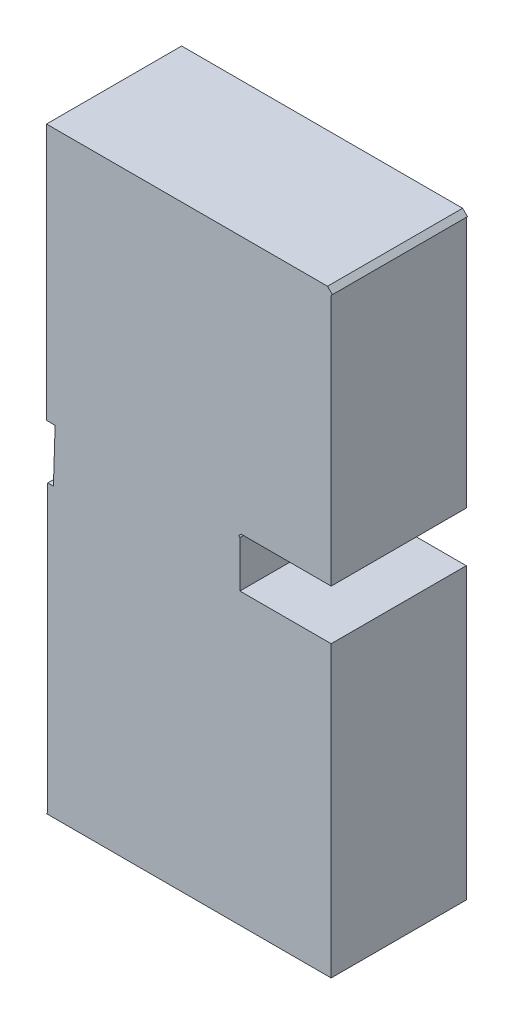
ISO-10303-21;
HEADER;
FILE_DESCRIPTION(('STEP AP214'),'2;1');
FILE_NAME('part.step','',(''),(''),'','','');
FILE_SCHEMA(('AUTOMOTIVE_DESIGN { 1 0 10303 214 1 1 1 1 }'));
ENDSEC;
DATA;
#1=APPLICATION_CONTEXT('core data for automotive mechanical design processes');
#2=APPLICATION_PROTOCOL_DEFINITION('international standard','automotive_design',2000,#1);
#3=PRODUCT_CONTEXT('',#1,'mechanical');
#4=PRODUCT('Part','Part','',(#3));
#5=PRODUCT_RELATED_PRODUCT_CATEGORY('part','',(#4));
#6=PRODUCT_DEFINITION_FORMATION('','',#4);
#7=PRODUCT_DEFINITION_CONTEXT('part definition',#1,'design');
#8=PRODUCT_DEFINITION('design','',#6,#7);
#9=PRODUCT_DEFINITION_SHAPE('','',#8);
#10=(LENGTH_UNIT() NAMED_UNIT(*) SI_UNIT(.MILLI.,.METRE.));
#11=(NAMED_UNIT(*) PLANE_ANGLE_UNIT() SI_UNIT($,.RADIAN.));
#12=(NAMED_UNIT(*) SI_UNIT($,.STERADIAN.) SOLID_ANGLE_UNIT());
#13=UNCERTAINTY_MEASURE_WITH_UNIT(LENGTH_MEASURE(1.E-05),#10,'distance_accuracy_value','');
#14=(GEOMETRIC_REPRESENTATION_CONTEXT(3) GLOBAL_UNCERTAINTY_ASSIGNED_CONTEXT((#13)) GLOBAL_UNIT_ASSIGNED_CONTEXT((#10,
#11,#12)) REPRESENTATION_CONTEXT('',''));
#15=CARTESIAN_POINT('',(0.,0.,0.));
#16=DIRECTION('',(0.,0.,1.));
#17=DIRECTION('',(1.,0.,0.));
#18=AXIS2_PLACEMENT_3D('',#15,#16,#17);
#19=CARTESIAN_POINT('',(-1.1635613,-2.4310975,1.10000034));
#20=DIRECTION('',(0.,0.,-1.));
#21=DIRECTION('',(0.,-1.,0.));
#22=AXIS2_PLACEMENT_3D('',#19,#20,#21);
#23=PLANE('',#22);
#24=DIRECTION('',(0.707106781186548,0.707106781186548,0.));
#25=VECTOR('',#24,1.);
#26=CARTESIAN_POINT('',(-1.1635613,-2.4310975,1.10000034));
#27=LINE('',#26,#25);
#28=CARTESIAN_POINT('',(-1.1635613,-2.4310975,1.10000034));
#29=VERTEX_POINT('',#28);
#30=CARTESIAN_POINT('',(-1.1536553,-2.4211915,1.10000034));
#31=VERTEX_POINT('',#30);
#32=EDGE_CURVE('E214',#29,#31,#27,.T.);
#33=ORIENTED_EDGE('',*,*,#32,.F.);
#34=DIRECTION('',(-1.,0.,0.));
#35=VECTOR('',#34,1.);
#36=CARTESIAN_POINT('',(1.1536807,-2.4310975,1.10000034));
#37=LINE('',#36,#35);
#38=CARTESIAN_POINT('',(1.1536807,-2.4310975,1.10000034));
#39=VERTEX_POINT('',#38);
#40=EDGE_CURVE('E28',#39,#29,#37,.T.);
#41=ORIENTED_EDGE('',*,*,#40,.F.);
#42=DIRECTION('',(0.,-1.,0.));
#43=VECTOR('',#42,1.);
#44=CARTESIAN_POINT('',(1.1536807,-0.0742569,1.10000034));
#45=LINE('',#44,#43);
#46=CARTESIAN_POINT('',(1.1536807,-0.0742569,1.10000034));
#47=VERTEX_POINT('',#46);
#48=EDGE_CURVE('E324',#47,#39,#45,.T.);
#49=ORIENTED_EDGE('',*,*,#48,.F.);
#50=DIRECTION('',(1.,0.,0.));
#51=VECTOR('',#50,1.);
#52=CARTESIAN_POINT('',(0.4109847,-0.0742569,1.10000034));
#53=LINE('',#52,#51);
#54=CARTESIAN_POINT('',(0.4109847,-0.0742569,1.10000034));
#55=VERTEX_POINT('',#54);
#56=EDGE_CURVE('E85',#55,#47,#53,.T.);
#57=ORIENTED_EDGE('',*,*,#56,.F.);
#58=DIRECTION('',(0.,-1.,0.));
#59=VECTOR('',#58,1.);
#60=CARTESIAN_POINT('',(0.4109847,0.3020441,1.10000034));
#61=LINE('',#60,#59);
#62=CARTESIAN_POINT('',(0.4109847,0.3020441,1.10000034));
#63=VERTEX_POINT('',#62);
#64=EDGE_CURVE('E340',#63,#55,#61,.T.);
#65=ORIENTED_EDGE('',*,*,#64,.F.);
#66=DIRECTION('',(0.707106781186548,-0.707106781186548,0.));
#67=VECTOR('',#66,1.);
#68=CARTESIAN_POINT('',(0.4010787,0.3119501,1.10000034));
#69=LINE('',#68,#67);
#70=CARTESIAN_POINT('',(0.4010787,0.3119501,1.10000034));
#71=VERTEX_POINT('',#70);
#72=EDGE_CURVE('E228',#71,#63,#69,.T.);
#73=ORIENTED_EDGE('',*,*,#72,.F.);
#74=DIRECTION('',(-0.707106781186548,-0.707106781186548,0.));
#75=VECTOR('',#74,1.);
#76=CARTESIAN_POINT('',(0.4208653,0.3317367,1.10000034));
#77=LINE('',#76,#75);
#78=CARTESIAN_POINT('',(0.4208653,0.3317367,1.10000034));
#79=VERTEX_POINT('',#78);
#80=EDGE_CURVE('E244',#79,#71,#77,.T.);
#81=ORIENTED_EDGE('',*,*,#80,.F.);
#82=DIRECTION('',(-1.,0.,0.));
#83=VECTOR('',#82,1.);
#84=CARTESIAN_POINT('',(1.1536807,0.3317367,1.10000034));
#85=LINE('',#84,#83);
#86=CARTESIAN_POINT('',(1.1536807,0.3317367,1.10000034));
#87=VERTEX_POINT('',#86);
#88=EDGE_CURVE('E238',#87,#79,#85,.T.);
#89=ORIENTED_EDGE('',*,*,#88,.F.);
#90=DIRECTION('',(0.,-1.,0.));
#91=VECTOR('',#90,1.);
#92=CARTESIAN_POINT('',(1.1536807,2.3816183,1.10000034));
#93=LINE('',#92,#91);
#94=CARTESIAN_POINT('',(1.1536807,2.3816183,1.10000034));
#95=VERTEX_POINT('',#94);
#96=EDGE_CURVE('E21',#95,#87,#93,.T.);
#97=ORIENTED_EDGE('',*,*,#96,.F.);
#98=DIRECTION('',(-0.707106781186548,-0.707106781186548,0.));
#99=VECTOR('',#98,1.);
#100=CARTESIAN_POINT('',(1.1635613,2.3914989,1.10000034));
#101=LINE('',#100,#99);
#102=CARTESIAN_POINT('',(1.1635613,2.3914989,1.10000034));
#103=VERTEX_POINT('',#102);
#104=EDGE_CURVE('E257',#103,#95,#101,.T.);
#105=ORIENTED_EDGE('',*,*,#104,.F.);
#106=DIRECTION('',(0.707106781186548,-0.707106781186548,0.));
#107=VECTOR('',#106,1.);
#108=CARTESIAN_POINT('',(1.1239627,2.4310975,1.10000034));
#109=LINE('',#108,#107);
#110=CARTESIAN_POINT('',(1.1239627,2.4310975,1.10000034));
#111=VERTEX_POINT('',#110);
#112=EDGE_CURVE('E286',#111,#103,#109,.T.);
#113=ORIENTED_EDGE('',*,*,#112,.F.);
#114=DIRECTION('',(1.,0.,0.));
#115=VECTOR('',#114,1.);
#116=CARTESIAN_POINT('',(-1.1635613,2.4310975,1.10000034));
#117=LINE('',#116,#115);
#118=CARTESIAN_POINT('',(-1.1635613,2.4310975,1.10000034));
#119=VERTEX_POINT('',#118);
#120=EDGE_CURVE('E277',#119,#111,#117,.T.);
#121=ORIENTED_EDGE('',*,*,#120,.F.);
#122=DIRECTION('',(0.,1.,0.));
#123=VECTOR('',#122,1.);
#124=CARTESIAN_POINT('',(-1.1635613,0.3416427,1.10000034));
#125=LINE('',#124,#123);
#126=CARTESIAN_POINT('',(-1.1635613,0.3416427,1.10000034));
#127=VERTEX_POINT('',#126);
#128=EDGE_CURVE('E145',#127,#119,#125,.T.);
#129=ORIENTED_EDGE('',*,*,#128,.F.);
#130=DIRECTION('',(-1.,0.,0.));
#131=VECTOR('',#130,1.);
#132=CARTESIAN_POINT('',(-1.09340904,0.3416427,1.10000034));
#133=LINE('',#132,#131);
#134=CARTESIAN_POINT('',(-1.09340904,0.3416427,1.10000034));
#135=VERTEX_POINT('',#134);
#136=EDGE_CURVE('E226',#135,#127,#133,.T.);
#137=ORIENTED_EDGE('',*,*,#136,.F.);
#138=DIRECTION('',(0.0322887852650993,0.999478581234287,0.));
#139=VECTOR('',#138,1.);
#140=CARTESIAN_POINT('',(-1.10748826,-0.0941705,1.10000034));
#141=LINE('',#140,#139);
#142=CARTESIAN_POINT('',(-1.10748826,-0.0941705,1.10000034));
#143=VERTEX_POINT('',#142);
#144=EDGE_CURVE('E268',#143,#135,#141,.T.);
#145=ORIENTED_EDGE('',*,*,#144,.F.);
#146=DIRECTION('',(0.999997578459252,-0.00220069889627356,0.));
#147=VECTOR('',#146,1.);
#148=CARTESIAN_POINT('',(-1.1536553,-0.0940689,1.10000034));
#149=LINE('',#148,#147);
#150=CARTESIAN_POINT('',(-1.1536553,-0.0940689,1.10000034));
#151=VERTEX_POINT('',#150);
#152=EDGE_CURVE('E202',#151,#143,#149,.T.);
#153=ORIENTED_EDGE('',*,*,#152,.F.);
#154=DIRECTION('',(0.,1.,0.));
#155=VECTOR('',#154,1.);
#156=CARTESIAN_POINT('',(-1.1536553,-2.4211915,1.10000034));
#157=LINE('',#156,#155);
#158=EDGE_CURVE('E210',#31,#151,#157,.T.);
#159=ORIENTED_EDGE('',*,*,#158,.F.);
#160=EDGE_LOOP('',(#33,#41,#49,#57,#65,#73,#81,#89,#97,#105,#113,#121,#129,#137,#145,#153,#159));
#161=FACE_BOUND('',#160,.T.);
#162=ADVANCED_FACE('F17',(#161),#23,.F.);
#163=CARTESIAN_POINT('',(-1.1635613,-2.4310975,0.));
#164=DIRECTION('',(0.,0.,-1.));
#165=DIRECTION('',(0.,-1.,0.));
#166=AXIS2_PLACEMENT_3D('',#163,#164,#165);
#167=PLANE('',#166);
#168=DIRECTION('',(0.707106781186548,0.707106781186548,0.));
#169=VECTOR('',#168,1.);
#170=CARTESIAN_POINT('',(-1.1635613,-2.4310975,0.));
#171=LINE('',#170,#169);
#172=CARTESIAN_POINT('',(-1.1635613,-2.4310975,0.));
#173=VERTEX_POINT('',#172);
#174=CARTESIAN_POINT('',(-1.1536553,-2.4211915,0.));
#175=VERTEX_POINT('',#174);
#176=EDGE_CURVE('E205',#173,#175,#171,.T.);
#177=ORIENTED_EDGE('',*,*,#176,.T.);
#178=DIRECTION('',(0.,1.,0.));
#179=VECTOR('',#178,1.);
#180=CARTESIAN_POINT('',(-1.1536553,-2.4211915,0.));
#181=LINE('',#180,#179);
#182=CARTESIAN_POINT('',(-1.1536553,-0.0940689,0.));
#183=VERTEX_POINT('',#182);
#184=EDGE_CURVE('E190',#175,#183,#181,.T.);
#185=ORIENTED_EDGE('',*,*,#184,.T.);
#186=DIRECTION('',(0.999997578459252,-0.00220069889627356,0.));
#187=VECTOR('',#186,1.);
#188=CARTESIAN_POINT('',(-1.1536553,-0.0940689,0.));
#189=LINE('',#188,#187);
#190=CARTESIAN_POINT('',(-1.10748826,-0.0941705,0.));
#191=VERTEX_POINT('',#190);
#192=EDGE_CURVE('E271',#183,#191,#189,.T.);
#193=ORIENTED_EDGE('',*,*,#192,.T.);
#194=DIRECTION('',(0.0322887852650993,0.999478581234287,0.));
#195=VECTOR('',#194,1.);
#196=CARTESIAN_POINT('',(-1.10748826,-0.0941705,0.));
#197=LINE('',#196,#195);
#198=CARTESIAN_POINT('',(-1.09340904,0.3416427,0.));
#199=VERTEX_POINT('',#198);
#200=EDGE_CURVE('E267',#191,#199,#197,.T.);
#201=ORIENTED_EDGE('',*,*,#200,.T.);
#202=DIRECTION('',(-1.,0.,0.));
#203=VECTOR('',#202,1.);
#204=CARTESIAN_POINT('',(-1.09340904,0.3416427,0.));
#205=LINE('',#204,#203);
#206=CARTESIAN_POINT('',(-1.1635613,0.3416427,0.));
#207=VERTEX_POINT('',#206);
#208=EDGE_CURVE('E225',#199,#207,#205,.T.);
#209=ORIENTED_EDGE('',*,*,#208,.T.);
#210=DIRECTION('',(0.,1.,0.));
#211=VECTOR('',#210,1.);
#212=CARTESIAN_POINT('',(-1.1635613,0.3416427,0.));
#213=LINE('',#212,#211);
#214=CARTESIAN_POINT('',(-1.1635613,2.4310975,0.));
#215=VERTEX_POINT('',#214);
#216=EDGE_CURVE('E137',#207,#215,#213,.T.);
#217=ORIENTED_EDGE('',*,*,#216,.T.);
#218=DIRECTION('',(1.,0.,0.));
#219=VECTOR('',#218,1.);
#220=CARTESIAN_POINT('',(-1.1635613,2.4310975,0.));
#221=LINE('',#220,#219);
#222=CARTESIAN_POINT('',(1.1239627,2.4310975,0.));
#223=VERTEX_POINT('',#222);
#224=EDGE_CURVE('E282',#215,#223,#221,.T.);
#225=ORIENTED_EDGE('',*,*,#224,.T.);
#226=DIRECTION('',(0.707106781186548,-0.707106781186548,0.));
#227=VECTOR('',#226,1.);
#228=CARTESIAN_POINT('',(1.1239627,2.4310975,0.));
#229=LINE('',#228,#227);
#230=CARTESIAN_POINT('',(1.1635613,2.3914989,0.));
#231=VERTEX_POINT('',#230);
#232=EDGE_CURVE('E253',#223,#231,#229,.T.);
#233=ORIENTED_EDGE('',*,*,#232,.T.);
#234=DIRECTION('',(-0.707106781186548,-0.707106781186548,0.));
#235=VECTOR('',#234,1.);
#236=CARTESIAN_POINT('',(1.1635613,2.3914989,0.));
#237=LINE('',#236,#235);
#238=CARTESIAN_POINT('',(1.1536807,2.3816183,0.));
#239=VERTEX_POINT('',#238);
#240=EDGE_CURVE('E308',#231,#239,#237,.T.);
#241=ORIENTED_EDGE('',*,*,#240,.T.);
#242=DIRECTION('',(0.,-1.,0.));
#243=VECTOR('',#242,1.);
#244=CARTESIAN_POINT('',(1.1536807,2.3816183,0.));
#245=LINE('',#244,#243);
#246=CARTESIAN_POINT('',(1.1536807,0.3317367,0.));
#247=VERTEX_POINT('',#246);
#248=EDGE_CURVE('E234',#239,#247,#245,.T.);
#249=ORIENTED_EDGE('',*,*,#248,.T.);
#250=DIRECTION('',(-1.,0.,0.));
#251=VECTOR('',#250,1.);
#252=CARTESIAN_POINT('',(1.1536807,0.3317367,0.));
#253=LINE('',#252,#251);
#254=CARTESIAN_POINT('',(0.4208653,0.3317367,0.));
#255=VERTEX_POINT('',#254);
#256=EDGE_CURVE('E252',#247,#255,#253,.T.);
#257=ORIENTED_EDGE('',*,*,#256,.T.);
#258=DIRECTION('',(-0.707106781186548,-0.707106781186548,0.));
#259=VECTOR('',#258,1.);
#260=CARTESIAN_POINT('',(0.4208653,0.3317367,0.));
#261=LINE('',#260,#259);
#262=CARTESIAN_POINT('',(0.4010787,0.3119501,0.));
#263=VERTEX_POINT('',#262);
#264=EDGE_CURVE('E233',#255,#263,#261,.T.);
#265=ORIENTED_EDGE('',*,*,#264,.T.);
#266=DIRECTION('',(0.707106781186548,-0.707106781186548,0.));
#267=VECTOR('',#266,1.);
#268=CARTESIAN_POINT('',(0.4010787,0.3119501,0.));
#269=LINE('',#268,#267);
#270=CARTESIAN_POINT('',(0.4109847,0.3020441,0.));
#271=VERTEX_POINT('',#270);
#272=EDGE_CURVE('E262',#263,#271,#269,.T.);
#273=ORIENTED_EDGE('',*,*,#272,.T.);
#274=DIRECTION('',(0.,-1.,0.));
#275=VECTOR('',#274,1.);
#276=CARTESIAN_POINT('',(0.4109847,0.3020441,0.));
#277=LINE('',#276,#275);
#278=CARTESIAN_POINT('',(0.4109847,-0.0742569,0.));
#279=VERTEX_POINT('',#278);
#280=EDGE_CURVE('E245',#271,#279,#277,.T.);
#281=ORIENTED_EDGE('',*,*,#280,.T.);
#282=DIRECTION('',(1.,0.,0.));
#283=VECTOR('',#282,1.);
#284=CARTESIAN_POINT('',(0.4109847,-0.0742569,0.));
#285=LINE('',#284,#283);
#286=CARTESIAN_POINT('',(1.1536807,-0.0742569,0.));
#287=VERTEX_POINT('',#286);
#288=EDGE_CURVE('E70',#279,#287,#285,.T.);
#289=ORIENTED_EDGE('',*,*,#288,.T.);
#290=DIRECTION('',(0.,-1.,0.));
#291=VECTOR('',#290,1.);
#292=CARTESIAN_POINT('',(1.1536807,-0.0742569,0.));
#293=LINE('',#292,#291);
#294=CARTESIAN_POINT('',(1.1536807,-2.4310975,0.));
#295=VERTEX_POINT('',#294);
#296=EDGE_CURVE('E331',#287,#295,#293,.T.);
#297=ORIENTED_EDGE('',*,*,#296,.T.);
#298=DIRECTION('',(-1.,0.,0.));
#299=VECTOR('',#298,1.);
#300=CARTESIAN_POINT('',(1.1536807,-2.4310975,0.));
#301=LINE('',#300,#299);
#302=EDGE_CURVE('E11',#295,#173,#301,.T.);
#303=ORIENTED_EDGE('',*,*,#302,.T.);
#304=EDGE_LOOP('',(#177,#185,#193,#201,#209,#217,#225,#233,#241,#249,#257,#265,#273,#281,#289,
#297,#303));
#305=FACE_BOUND('',#304,.T.);
#306=ADVANCED_FACE('F206',(#305),#167,.T.);
#307=CARTESIAN_POINT('',(1.1536807,-2.4310975,0.));
#308=DIRECTION('',(0.,-1.,0.));
#309=DIRECTION('',(0.,0.,-1.));
#310=AXIS2_PLACEMENT_3D('',#307,#308,#309);
#311=PLANE('',#310);
#312=DIRECTION('',(0.,0.,1.));
#313=VECTOR('',#312,1.);
#314=CARTESIAN_POINT('',(1.1536807,-2.4310975,0.));
#315=LINE('',#314,#313);
#316=EDGE_CURVE('E327',#295,#39,#315,.T.);
#317=ORIENTED_EDGE('',*,*,#316,.T.);
#318=ORIENTED_EDGE('',*,*,#40,.T.);
#319=DIRECTION('',(0.,0.,1.));
#320=VECTOR('',#319,1.);
#321=CARTESIAN_POINT('',(-1.1635613,-2.4310975,0.));
#322=LINE('',#321,#320);
#323=EDGE_CURVE('E220',#173,#29,#322,.T.);
#324=ORIENTED_EDGE('',*,*,#323,.F.);
#325=ORIENTED_EDGE('',*,*,#302,.F.);
#326=EDGE_LOOP('',(#317,#318,#324,#325));
#327=FACE_BOUND('',#326,.T.);
#328=ADVANCED_FACE('F406',(#327),#311,.T.);
#329=CARTESIAN_POINT('',(1.1536807,-0.0742569,0.));
#330=DIRECTION('',(1.,0.,0.));
#331=DIRECTION('',(0.,1.,0.));
#332=AXIS2_PLACEMENT_3D('',#329,#330,#331);
#333=PLANE('',#332);
#334=DIRECTION('',(0.,0.,1.));
#335=VECTOR('',#334,1.);
#336=CARTESIAN_POINT('',(1.1536807,-0.0742569,0.));
#337=LINE('',#336,#335);
#338=EDGE_CURVE('E346',#287,#47,#337,.T.);
#339=ORIENTED_EDGE('',*,*,#338,.T.);
#340=ORIENTED_EDGE('',*,*,#48,.T.);
#341=ORIENTED_EDGE('',*,*,#316,.F.);
#342=ORIENTED_EDGE('',*,*,#296,.F.);
#343=EDGE_LOOP('',(#339,#340,#341,#342));
#344=FACE_BOUND('',#343,.T.);
#345=ADVANCED_FACE('F409',(#344),#333,.T.);
#346=CARTESIAN_POINT('',(0.4109847,-0.0742569,0.));
#347=DIRECTION('',(0.,1.,0.));
#348=DIRECTION('',(1.,0.,0.));
#349=AXIS2_PLACEMENT_3D('',#346,#347,#348);
#350=PLANE('',#349);
#351=DIRECTION('',(0.,0.,1.));
#352=VECTOR('',#351,1.);
#353=CARTESIAN_POINT('',(0.4109847,-0.0742569,0.));
#354=LINE('',#353,#352);
#355=EDGE_CURVE('E248',#279,#55,#354,.T.);
#356=ORIENTED_EDGE('',*,*,#355,.T.);
#357=ORIENTED_EDGE('',*,*,#56,.T.);
#358=ORIENTED_EDGE('',*,*,#338,.F.);
#359=ORIENTED_EDGE('',*,*,#288,.F.);
#360=EDGE_LOOP('',(#356,#357,#358,#359));
#361=FACE_BOUND('',#360,.T.);
#362=ADVANCED_FACE('F410',(#361),#350,.T.);
#363=CARTESIAN_POINT('',(0.4109847,0.3020441,0.));
#364=DIRECTION('',(1.,0.,0.));
#365=DIRECTION('',(0.,1.,0.));
#366=AXIS2_PLACEMENT_3D('',#363,#364,#365);
#367=PLANE('',#366);
#368=DIRECTION('',(0.,0.,1.));
#369=VECTOR('',#368,1.);
#370=CARTESIAN_POINT('',(0.4109847,0.3020441,0.));
#371=LINE('',#370,#369);
#372=EDGE_CURVE('E232',#271,#63,#371,.T.);
#373=ORIENTED_EDGE('',*,*,#372,.T.);
#374=ORIENTED_EDGE('',*,*,#64,.T.);
#375=ORIENTED_EDGE('',*,*,#355,.F.);
#376=ORIENTED_EDGE('',*,*,#280,.F.);
#377=EDGE_LOOP('',(#373,#374,#375,#376));
#378=FACE_BOUND('',#377,.T.);
#379=ADVANCED_FACE('F413',(#378),#367,.T.);
#380=CARTESIAN_POINT('',(0.4010787,0.3119501,0.));
#381=DIRECTION('',(0.707106781186548,0.707106781186548,0.));
#382=DIRECTION('',(0.,0.,-1.));
#383=AXIS2_PLACEMENT_3D('',#380,#381,#382);
#384=PLANE('',#383);
#385=DIRECTION('',(0.,0.,1.));
#386=VECTOR('',#385,1.);
#387=CARTESIAN_POINT('',(0.4010787,0.3119501,0.));
#388=LINE('',#387,#386);
#389=EDGE_CURVE('E240',#263,#71,#388,.T.);
#390=ORIENTED_EDGE('',*,*,#389,.T.);
#391=ORIENTED_EDGE('',*,*,#72,.T.);
#392=ORIENTED_EDGE('',*,*,#372,.F.);
#393=ORIENTED_EDGE('',*,*,#272,.F.);
#394=EDGE_LOOP('',(#390,#391,#392,#393));
#395=FACE_BOUND('',#394,.T.);
#396=ADVANCED_FACE('F417',(#395),#384,.T.);
#397=CARTESIAN_POINT('',(0.4208653,0.3317367,0.));
#398=DIRECTION('',(0.707106781186548,-0.707106781186548,0.));
#399=DIRECTION('',(0.,0.,-1.));
#400=AXIS2_PLACEMENT_3D('',#397,#398,#399);
#401=PLANE('',#400);
#402=DIRECTION('',(0.,0.,1.));
#403=VECTOR('',#402,1.);
#404=CARTESIAN_POINT('',(0.4208653,0.3317367,0.));
#405=LINE('',#404,#403);
#406=EDGE_CURVE('E291',#255,#79,#405,.T.);
#407=ORIENTED_EDGE('',*,*,#406,.T.);
#408=ORIENTED_EDGE('',*,*,#80,.T.);
#409=ORIENTED_EDGE('',*,*,#389,.F.);
#410=ORIENTED_EDGE('',*,*,#264,.F.);
#411=EDGE_LOOP('',(#407,#408,#409,#410));
#412=FACE_BOUND('',#411,.T.);
#413=ADVANCED_FACE('F419',(#412),#401,.T.);
#414=CARTESIAN_POINT('',(1.1536807,0.3317367,0.));
#415=DIRECTION('',(0.,-1.,0.));
#416=DIRECTION('',(0.,0.,-1.));
#417=AXIS2_PLACEMENT_3D('',#414,#415,#416);
#418=PLANE('',#417);
#419=DIRECTION('',(0.,0.,1.));
#420=VECTOR('',#419,1.);
#421=CARTESIAN_POINT('',(1.1536807,0.3317367,0.));
#422=LINE('',#421,#420);
#423=EDGE_CURVE('E239',#247,#87,#422,.T.);
#424=ORIENTED_EDGE('',*,*,#423,.T.);
#425=ORIENTED_EDGE('',*,*,#88,.T.);
#426=ORIENTED_EDGE('',*,*,#406,.F.);
#427=ORIENTED_EDGE('',*,*,#256,.F.);
#428=EDGE_LOOP('',(#424,#425,#426,#427));
#429=FACE_BOUND('',#428,.T.);
#430=ADVANCED_FACE('F19',(#429),#418,.T.);
#431=CARTESIAN_POINT('',(1.1536807,2.3816183,0.));
#432=DIRECTION('',(1.,0.,0.));
#433=DIRECTION('',(0.,1.,0.));
#434=AXIS2_PLACEMENT_3D('',#431,#432,#433);
#435=PLANE('',#434);
#436=DIRECTION('',(0.,0.,1.));
#437=VECTOR('',#436,1.);
#438=CARTESIAN_POINT('',(1.1536807,2.3816183,0.));
#439=LINE('',#438,#437);
#440=EDGE_CURVE('E312',#239,#95,#439,.T.);
#441=ORIENTED_EDGE('',*,*,#440,.T.);
#442=ORIENTED_EDGE('',*,*,#96,.T.);
#443=ORIENTED_EDGE('',*,*,#423,.F.);
#444=ORIENTED_EDGE('',*,*,#248,.F.);
#445=EDGE_LOOP('',(#441,#442,#443,#444));
#446=FACE_BOUND('',#445,.T.);
#447=ADVANCED_FACE('F469',(#446),#435,.T.);
#448=CARTESIAN_POINT('',(1.1635613,2.3914989,0.));
#449=DIRECTION('',(0.707106781186548,-0.707106781186548,0.));
#450=DIRECTION('',(0.,0.,-1.));
#451=AXIS2_PLACEMENT_3D('',#448,#449,#450);
#452=PLANE('',#451);
#453=DIRECTION('',(0.,0.,1.));
#454=VECTOR('',#453,1.);
#455=CARTESIAN_POINT('',(1.1635613,2.3914989,0.));
#456=LINE('',#455,#454);
#457=EDGE_CURVE('E258',#231,#103,#456,.T.);
#458=ORIENTED_EDGE('',*,*,#457,.T.);
#459=ORIENTED_EDGE('',*,*,#104,.T.);
#460=ORIENTED_EDGE('',*,*,#440,.F.);
#461=ORIENTED_EDGE('',*,*,#240,.F.);
#462=EDGE_LOOP('',(#458,#459,#460,#461));
#463=FACE_BOUND('',#462,.T.);
#464=ADVANCED_FACE('F391',(#463),#452,.T.);
#465=CARTESIAN_POINT('',(1.1239627,2.4310975,0.));
#466=DIRECTION('',(0.707106781186548,0.707106781186548,0.));
#467=DIRECTION('',(0.,0.,-1.));
#468=AXIS2_PLACEMENT_3D('',#465,#466,#467);
#469=PLANE('',#468);
#470=DIRECTION('',(0.,0.,1.));
#471=VECTOR('',#470,1.);
#472=CARTESIAN_POINT('',(1.1239627,2.4310975,0.));
#473=LINE('',#472,#471);
#474=EDGE_CURVE('E287',#223,#111,#473,.T.);
#475=ORIENTED_EDGE('',*,*,#474,.T.);
#476=ORIENTED_EDGE('',*,*,#112,.T.);
#477=ORIENTED_EDGE('',*,*,#457,.F.);
#478=ORIENTED_EDGE('',*,*,#232,.F.);
#479=EDGE_LOOP('',(#475,#476,#477,#478));
#480=FACE_BOUND('',#479,.T.);
#481=ADVANCED_FACE('F382',(#480),#469,.T.);
#482=CARTESIAN_POINT('',(-1.1635613,2.4310975,0.));
#483=DIRECTION('',(0.,1.,0.));
#484=DIRECTION('',(1.,0.,0.));
#485=AXIS2_PLACEMENT_3D('',#482,#483,#484);
#486=PLANE('',#485);
#487=DIRECTION('',(0.,0.,1.));
#488=VECTOR('',#487,1.);
#489=CARTESIAN_POINT('',(-1.1635613,2.4310975,0.));
#490=LINE('',#489,#488);
#491=EDGE_CURVE('E278',#215,#119,#490,.T.);
#492=ORIENTED_EDGE('',*,*,#491,.T.);
#493=ORIENTED_EDGE('',*,*,#120,.T.);
#494=ORIENTED_EDGE('',*,*,#474,.F.);
#495=ORIENTED_EDGE('',*,*,#224,.F.);
#496=EDGE_LOOP('',(#492,#493,#494,#495));
#497=FACE_BOUND('',#496,.T.);
#498=ADVANCED_FACE('F386',(#497),#486,.T.);
#499=CARTESIAN_POINT('',(-1.1635613,0.3416427,0.));
#500=DIRECTION('',(-1.,0.,0.));
#501=DIRECTION('',(0.,0.,1.));
#502=AXIS2_PLACEMENT_3D('',#499,#500,#501);
#503=PLANE('',#502);
#504=DIRECTION('',(0.,0.,1.));
#505=VECTOR('',#504,1.);
#506=CARTESIAN_POINT('',(-1.1635613,0.3416427,0.));
#507=LINE('',#506,#505);
#508=EDGE_CURVE('E223',#207,#127,#507,.T.);
#509=ORIENTED_EDGE('',*,*,#508,.T.);
#510=ORIENTED_EDGE('',*,*,#128,.T.);
#511=ORIENTED_EDGE('',*,*,#491,.F.);
#512=ORIENTED_EDGE('',*,*,#216,.F.);
#513=EDGE_LOOP('',(#509,#510,#511,#512));
#514=FACE_BOUND('',#513,.T.);
#515=ADVANCED_FACE('F396',(#514),#503,.T.);
#516=CARTESIAN_POINT('',(-1.09340904,0.3416427,0.));
#517=DIRECTION('',(0.,-1.,0.));
#518=DIRECTION('',(0.,0.,-1.));
#519=AXIS2_PLACEMENT_3D('',#516,#517,#518);
#520=PLANE('',#519);
#521=DIRECTION('',(0.,0.,1.));
#522=VECTOR('',#521,1.);
#523=CARTESIAN_POINT('',(-1.09340904,0.3416427,0.));
#524=LINE('',#523,#522);
#525=EDGE_CURVE('E263',#199,#135,#524,.T.);
#526=ORIENTED_EDGE('',*,*,#525,.T.);
#527=ORIENTED_EDGE('',*,*,#136,.T.);
#528=ORIENTED_EDGE('',*,*,#508,.F.);
#529=ORIENTED_EDGE('',*,*,#208,.F.);
#530=EDGE_LOOP('',(#526,#527,#528,#529));
#531=FACE_BOUND('',#530,.T.);
#532=ADVANCED_FACE('F398',(#531),#520,.T.);
#533=CARTESIAN_POINT('',(-1.10748826,-0.0941705,0.));
#534=DIRECTION('',(-0.999478581234287,0.0322887852650993,0.));
#535=DIRECTION('',(0.,0.,1.));
#536=AXIS2_PLACEMENT_3D('',#533,#534,#535);
#537=PLANE('',#536);
#538=DIRECTION('',(0.,0.,1.));
#539=VECTOR('',#538,1.);
#540=CARTESIAN_POINT('',(-1.10748826,-0.0941705,0.));
#541=LINE('',#540,#539);
#542=EDGE_CURVE('E274',#191,#143,#541,.T.);
#543=ORIENTED_EDGE('',*,*,#542,.T.);
#544=ORIENTED_EDGE('',*,*,#144,.T.);
#545=ORIENTED_EDGE('',*,*,#525,.F.);
#546=ORIENTED_EDGE('',*,*,#200,.F.);
#547=EDGE_LOOP('',(#543,#544,#545,#546));
#548=FACE_BOUND('',#547,.T.);
#549=ADVANCED_FACE('F403',(#548),#537,.T.);
#550=CARTESIAN_POINT('',(-1.1536553,-0.0940689,0.));
#551=DIRECTION('',(0.00220069889627355,0.999997578459252,0.));
#552=DIRECTION('',(0.,0.,-1.));
#553=AXIS2_PLACEMENT_3D('',#550,#551,#552);
#554=PLANE('',#553);
#555=DIRECTION('',(0.,0.,1.));
#556=VECTOR('',#555,1.);
#557=CARTESIAN_POINT('',(-1.1536553,-0.0940689,0.));
#558=LINE('',#557,#556);
#559=EDGE_CURVE('E198',#183,#151,#558,.T.);
#560=ORIENTED_EDGE('',*,*,#559,.T.);
#561=ORIENTED_EDGE('',*,*,#152,.T.);
#562=ORIENTED_EDGE('',*,*,#542,.F.);
#563=ORIENTED_EDGE('',*,*,#192,.F.);
#564=EDGE_LOOP('',(#560,#561,#562,#563));
#565=FACE_BOUND('',#564,.T.);
#566=ADVANCED_FACE('F405',(#565),#554,.T.);
#567=CARTESIAN_POINT('',(-1.1536553,-2.4211915,0.));
#568=DIRECTION('',(-1.,0.,0.));
#569=DIRECTION('',(0.,0.,1.));
#570=AXIS2_PLACEMENT_3D('',#567,#568,#569);
#571=PLANE('',#570);
#572=DIRECTION('',(0.,0.,1.));
#573=VECTOR('',#572,1.);
#574=CARTESIAN_POINT('',(-1.1536553,-2.4211915,0.));
#575=LINE('',#574,#573);
#576=EDGE_CURVE('E195',#175,#31,#575,.T.);
#577=ORIENTED_EDGE('',*,*,#576,.T.);
#578=ORIENTED_EDGE('',*,*,#158,.T.);
#579=ORIENTED_EDGE('',*,*,#559,.F.);
#580=ORIENTED_EDGE('',*,*,#184,.F.);
#581=EDGE_LOOP('',(#577,#578,#579,#580));
#582=FACE_BOUND('',#581,.T.);
#583=ADVANCED_FACE('F192',(#582),#571,.T.);
#584=CARTESIAN_POINT('',(-1.1635613,-2.4310975,0.));
#585=DIRECTION('',(-0.707106781186548,0.707106781186548,0.));
#586=DIRECTION('',(0.,0.,1.));
#587=AXIS2_PLACEMENT_3D('',#584,#585,#586);
#588=PLANE('',#587);
#589=ORIENTED_EDGE('',*,*,#323,.T.);
#590=ORIENTED_EDGE('',*,*,#32,.T.);
#591=ORIENTED_EDGE('',*,*,#576,.F.);
#592=ORIENTED_EDGE('',*,*,#176,.F.);
#593=EDGE_LOOP('',(#589,#590,#591,#592));
#594=FACE_BOUND('',#593,.T.);
#595=ADVANCED_FACE('F212',(#594),#588,.T.);
#596=CLOSED_SHELL('',(#162,#306,#328,#345,#362,#379,#396,#413,#430,#447,#464,#481,#498,#515,
#532,#549,#566,#583,#595));
#597=MANIFOLD_SOLID_BREP('B1',#596);
#598=ADVANCED_BREP_SHAPE_REPRESENTATION('',(#18,#597),#14);
#599=SHAPE_DEFINITION_REPRESENTATION(#9,#598);
ENDSEC;
END-ISO-10303-21;
